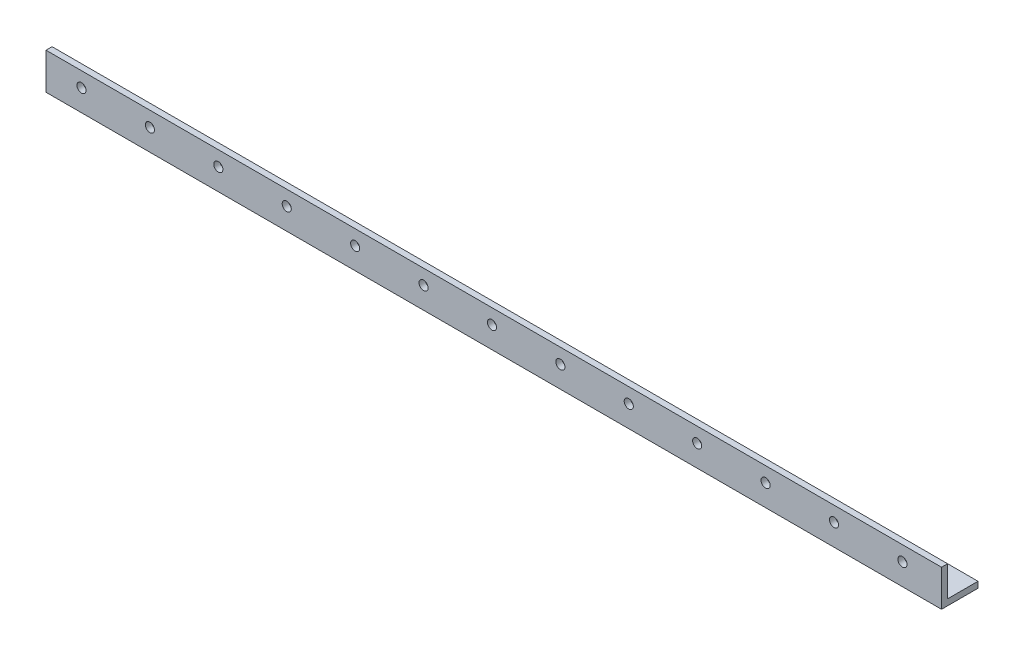
ISO-10303-21;
HEADER;
FILE_DESCRIPTION(('STEP AP214'),'2;1');
FILE_NAME('part.step','',(''),(''),'','','');
FILE_SCHEMA(('AUTOMOTIVE_DESIGN { 1 0 10303 214 1 1 1 1 }'));
ENDSEC;
DATA;
#1=APPLICATION_CONTEXT('core data for automotive mechanical design processes');
#2=APPLICATION_PROTOCOL_DEFINITION('international standard','automotive_design',2000,#1);
#3=PRODUCT_CONTEXT('',#1,'mechanical');
#4=PRODUCT('Part','Part','',(#3));
#5=PRODUCT_RELATED_PRODUCT_CATEGORY('part','',(#4));
#6=PRODUCT_DEFINITION_FORMATION('','',#4);
#7=PRODUCT_DEFINITION_CONTEXT('part definition',#1,'design');
#8=PRODUCT_DEFINITION('design','',#6,#7);
#9=PRODUCT_DEFINITION_SHAPE('','',#8);
#10=(LENGTH_UNIT() NAMED_UNIT(*) SI_UNIT(.MILLI.,.METRE.));
#11=(NAMED_UNIT(*) PLANE_ANGLE_UNIT() SI_UNIT($,.RADIAN.));
#12=(NAMED_UNIT(*) SI_UNIT($,.STERADIAN.) SOLID_ANGLE_UNIT());
#13=UNCERTAINTY_MEASURE_WITH_UNIT(LENGTH_MEASURE(1.E-05),#10,'distance_accuracy_value','');
#14=(GEOMETRIC_REPRESENTATION_CONTEXT(3) GLOBAL_UNCERTAINTY_ASSIGNED_CONTEXT((#13)) GLOBAL_UNIT_ASSIGNED_CONTEXT((#10,
#11,#12)) REPRESENTATION_CONTEXT('',''));
#15=CARTESIAN_POINT('',(0.,0.,0.));
#16=DIRECTION('',(0.,0.,1.));
#17=DIRECTION('',(1.,0.,0.));
#18=AXIS2_PLACEMENT_3D('',#15,#16,#17);
#19=CARTESIAN_POINT('',(-468.,0.,-19.05));
#20=DIRECTION('',(0.,-1.,0.));
#21=DIRECTION('',(0.,0.,-1.));
#22=AXIS2_PLACEMENT_3D('',#19,#20,#21);
#23=PLANE('',#22);
#24=DIRECTION('',(0.,0.,-1.));
#25=VECTOR('',#24,1.);
#26=CARTESIAN_POINT('',(0.,0.,-19.05));
#27=LINE('',#26,#25);
#28=CARTESIAN_POINT('',(0.,0.,0.));
#29=VERTEX_POINT('',#28);
#30=CARTESIAN_POINT('',(0.,0.,-19.05));
#31=VERTEX_POINT('',#30);
#32=EDGE_CURVE('E118',#29,#31,#27,.T.);
#33=ORIENTED_EDGE('',*,*,#32,.F.);
#34=DIRECTION('',(1.,0.,0.));
#35=VECTOR('',#34,1.);
#36=CARTESIAN_POINT('',(-468.,0.,0.));
#37=LINE('',#36,#35);
#38=CARTESIAN_POINT('',(-468.,0.,0.));
#39=VERTEX_POINT('',#38);
#40=EDGE_CURVE('E11',#39,#29,#37,.T.);
#41=ORIENTED_EDGE('',*,*,#40,.F.);
#42=DIRECTION('',(0.,0.,-1.));
#43=VECTOR('',#42,1.);
#44=CARTESIAN_POINT('',(-468.,0.,-19.05));
#45=LINE('',#44,#43);
#46=CARTESIAN_POINT('',(-468.,0.,-19.05));
#47=VERTEX_POINT('',#46);
#48=EDGE_CURVE('E133',#39,#47,#45,.T.);
#49=ORIENTED_EDGE('',*,*,#48,.T.);
#50=DIRECTION('',(1.,0.,0.));
#51=VECTOR('',#50,1.);
#52=CARTESIAN_POINT('',(-468.,0.,-19.05));
#53=LINE('',#52,#51);
#54=EDGE_CURVE('E36',#47,#31,#53,.T.);
#55=ORIENTED_EDGE('',*,*,#54,.T.);
#56=EDGE_LOOP('',(#33,#41,#49,#55));
#57=FACE_BOUND('',#56,.T.);
#58=ADVANCED_FACE('F33',(#57),#23,.T.);
#59=CARTESIAN_POINT('',(-468.,0.,0.));
#60=DIRECTION('',(0.,0.,1.));
#61=DIRECTION('',(1.,0.,0.));
#62=AXIS2_PLACEMENT_3D('',#59,#60,#61);
#63=PLANE('',#62);
#64=CARTESIAN_POINT('',(-20.45,11.2735467227539,0.));
#65=DIRECTION('',(0.,0.,1.));
#66=DIRECTION('',(1.,0.,0.));
#67=AXIS2_PLACEMENT_3D('',#64,#65,#66);
#68=CIRCLE('',#67,2.38125);
#69=CARTESIAN_POINT('',(-18.06875,11.2735467227539,0.));
#70=VERTEX_POINT('',#69);
#71=EDGE_CURVE('E227',#70,#70,#68,.T.);
#72=ORIENTED_EDGE('',*,*,#71,.F.);
#73=EDGE_LOOP('',(#72));
#74=FACE_BOUND('',#73,.T.);
#75=CARTESIAN_POINT('',(-56.2,11.2735467227539,0.));
#76=DIRECTION('',(0.,0.,1.));
#77=DIRECTION('',(1.,0.,0.));
#78=AXIS2_PLACEMENT_3D('',#75,#76,#77);
#79=CIRCLE('',#78,2.38125);
#80=CARTESIAN_POINT('',(-53.81875,11.2735467227539,0.));
#81=VERTEX_POINT('',#80);
#82=EDGE_CURVE('E229',#81,#81,#79,.T.);
#83=ORIENTED_EDGE('',*,*,#82,.F.);
#84=EDGE_LOOP('',(#83));
#85=FACE_BOUND('',#84,.T.);
#86=CARTESIAN_POINT('',(-91.95,11.2735467227539,0.));
#87=DIRECTION('',(0.,0.,1.));
#88=DIRECTION('',(1.,0.,0.));
#89=AXIS2_PLACEMENT_3D('',#86,#87,#88);
#90=CIRCLE('',#89,2.38125000000001);
#91=CARTESIAN_POINT('',(-89.56875,11.2735467227539,0.));
#92=VERTEX_POINT('',#91);
#93=EDGE_CURVE('E235',#92,#92,#90,.T.);
#94=ORIENTED_EDGE('',*,*,#93,.F.);
#95=EDGE_LOOP('',(#94));
#96=FACE_BOUND('',#95,.T.);
#97=CARTESIAN_POINT('',(-127.7,11.2735467227539,0.));
#98=DIRECTION('',(0.,0.,1.));
#99=DIRECTION('',(1.,0.,0.));
#100=AXIS2_PLACEMENT_3D('',#97,#98,#99);
#101=CIRCLE('',#100,2.38125000000001);
#102=CARTESIAN_POINT('',(-125.31875,11.2735467227539,0.));
#103=VERTEX_POINT('',#102);
#104=EDGE_CURVE('E241',#103,#103,#101,.T.);
#105=ORIENTED_EDGE('',*,*,#104,.F.);
#106=EDGE_LOOP('',(#105));
#107=FACE_BOUND('',#106,.T.);
#108=CARTESIAN_POINT('',(-163.45,11.2735467227539,0.));
#109=DIRECTION('',(0.,0.,1.));
#110=DIRECTION('',(1.,0.,0.));
#111=AXIS2_PLACEMENT_3D('',#108,#109,#110);
#112=CIRCLE('',#111,2.38125000000001);
#113=CARTESIAN_POINT('',(-161.06875,11.2735467227539,0.));
#114=VERTEX_POINT('',#113);
#115=EDGE_CURVE('E247',#114,#114,#112,.T.);
#116=ORIENTED_EDGE('',*,*,#115,.F.);
#117=EDGE_LOOP('',(#116));
#118=FACE_BOUND('',#117,.T.);
#119=CARTESIAN_POINT('',(-199.2,11.2735467227539,0.));
#120=DIRECTION('',(0.,0.,1.));
#121=DIRECTION('',(1.,0.,0.));
#122=AXIS2_PLACEMENT_3D('',#119,#120,#121);
#123=CIRCLE('',#122,2.38125000000001);
#124=CARTESIAN_POINT('',(-196.81875,11.2735467227539,0.));
#125=VERTEX_POINT('',#124);
#126=EDGE_CURVE('E253',#125,#125,#123,.T.);
#127=ORIENTED_EDGE('',*,*,#126,.F.);
#128=EDGE_LOOP('',(#127));
#129=FACE_BOUND('',#128,.T.);
#130=CARTESIAN_POINT('',(-234.95,11.2735467227539,0.));
#131=DIRECTION('',(0.,0.,1.));
#132=DIRECTION('',(1.,0.,0.));
#133=AXIS2_PLACEMENT_3D('',#130,#131,#132);
#134=CIRCLE('',#133,2.38125000000001);
#135=CARTESIAN_POINT('',(-232.56875,11.2735467227539,0.));
#136=VERTEX_POINT('',#135);
#137=EDGE_CURVE('E259',#136,#136,#134,.T.);
#138=ORIENTED_EDGE('',*,*,#137,.F.);
#139=EDGE_LOOP('',(#138));
#140=FACE_BOUND('',#139,.T.);
#141=CARTESIAN_POINT('',(-270.7,11.2735467227539,0.));
#142=DIRECTION('',(0.,0.,1.));
#143=DIRECTION('',(1.,0.,0.));
#144=AXIS2_PLACEMENT_3D('',#141,#142,#143);
#145=CIRCLE('',#144,2.38125000000001);
#146=CARTESIAN_POINT('',(-268.31875,11.2735467227539,0.));
#147=VERTEX_POINT('',#146);
#148=EDGE_CURVE('E265',#147,#147,#145,.T.);
#149=ORIENTED_EDGE('',*,*,#148,.F.);
#150=EDGE_LOOP('',(#149));
#151=FACE_BOUND('',#150,.T.);
#152=CARTESIAN_POINT('',(-306.45,11.2735467227539,0.));
#153=DIRECTION('',(0.,0.,1.));
#154=DIRECTION('',(1.,0.,0.));
#155=AXIS2_PLACEMENT_3D('',#152,#153,#154);
#156=CIRCLE('',#155,2.38125000000001);
#157=CARTESIAN_POINT('',(-304.06875,11.2735467227539,0.));
#158=VERTEX_POINT('',#157);
#159=EDGE_CURVE('E271',#158,#158,#156,.T.);
#160=ORIENTED_EDGE('',*,*,#159,.F.);
#161=EDGE_LOOP('',(#160));
#162=FACE_BOUND('',#161,.T.);
#163=CARTESIAN_POINT('',(-342.2,11.2735467227539,0.));
#164=DIRECTION('',(0.,0.,1.));
#165=DIRECTION('',(1.,0.,0.));
#166=AXIS2_PLACEMENT_3D('',#163,#164,#165);
#167=CIRCLE('',#166,2.38125000000001);
#168=CARTESIAN_POINT('',(-339.81875,11.2735467227539,0.));
#169=VERTEX_POINT('',#168);
#170=EDGE_CURVE('E277',#169,#169,#167,.T.);
#171=ORIENTED_EDGE('',*,*,#170,.F.);
#172=EDGE_LOOP('',(#171));
#173=FACE_BOUND('',#172,.T.);
#174=CARTESIAN_POINT('',(-377.95,11.2735467227539,0.));
#175=DIRECTION('',(0.,0.,1.));
#176=DIRECTION('',(1.,0.,0.));
#177=AXIS2_PLACEMENT_3D('',#174,#175,#176);
#178=CIRCLE('',#177,2.38125000000001);
#179=CARTESIAN_POINT('',(-375.56875,11.2735467227539,0.));
#180=VERTEX_POINT('',#179);
#181=EDGE_CURVE('E283',#180,#180,#178,.T.);
#182=ORIENTED_EDGE('',*,*,#181,.F.);
#183=EDGE_LOOP('',(#182));
#184=FACE_BOUND('',#183,.T.);
#185=CARTESIAN_POINT('',(-413.7,11.2735467227539,0.));
#186=DIRECTION('',(0.,0.,1.));
#187=DIRECTION('',(1.,0.,0.));
#188=AXIS2_PLACEMENT_3D('',#185,#186,#187);
#189=CIRCLE('',#188,2.38125000000001);
#190=CARTESIAN_POINT('',(-411.31875,11.2735467227539,0.));
#191=VERTEX_POINT('',#190);
#192=EDGE_CURVE('E289',#191,#191,#189,.T.);
#193=ORIENTED_EDGE('',*,*,#192,.F.);
#194=EDGE_LOOP('',(#193));
#195=FACE_BOUND('',#194,.T.);
#196=CARTESIAN_POINT('',(-449.45,11.2735467227539,0.));
#197=DIRECTION('',(0.,0.,1.));
#198=DIRECTION('',(1.,0.,0.));
#199=AXIS2_PLACEMENT_3D('',#196,#197,#198);
#200=CIRCLE('',#199,2.38125000000001);
#201=CARTESIAN_POINT('',(-447.06875,11.2735467227539,0.));
#202=VERTEX_POINT('',#201);
#203=EDGE_CURVE('E295',#202,#202,#200,.T.);
#204=ORIENTED_EDGE('',*,*,#203,.F.);
#205=EDGE_LOOP('',(#204));
#206=FACE_BOUND('',#205,.T.);
#207=DIRECTION('',(0.,-1.,0.));
#208=VECTOR('',#207,1.);
#209=CARTESIAN_POINT('',(0.,0.,0.));
#210=LINE('',#209,#208);
#211=CARTESIAN_POINT('',(0.,19.05,0.));
#212=VERTEX_POINT('',#211);
#213=EDGE_CURVE('E131',#212,#29,#210,.T.);
#214=ORIENTED_EDGE('',*,*,#213,.F.);
#215=DIRECTION('',(1.,0.,0.));
#216=VECTOR('',#215,1.);
#217=CARTESIAN_POINT('',(-468.,19.05,0.));
#218=LINE('',#217,#216);
#219=CARTESIAN_POINT('',(-468.,19.05,0.));
#220=VERTEX_POINT('',#219);
#221=EDGE_CURVE('E42',#220,#212,#218,.T.);
#222=ORIENTED_EDGE('',*,*,#221,.F.);
#223=DIRECTION('',(0.,-1.,0.));
#224=VECTOR('',#223,1.);
#225=CARTESIAN_POINT('',(-468.,0.,0.));
#226=LINE('',#225,#224);
#227=EDGE_CURVE('E108',#220,#39,#226,.T.);
#228=ORIENTED_EDGE('',*,*,#227,.T.);
#229=ORIENTED_EDGE('',*,*,#40,.T.);
#230=EDGE_LOOP('',(#214,#222,#228,#229));
#231=FACE_BOUND('',#230,.T.);
#232=ADVANCED_FACE('F141',(#74,#85,#96,#107,#118,#129,#140,#151,#162,#173,#184,#195,#206,#231),
#63,.T.);
#233=CARTESIAN_POINT('',(-468.,19.05,0.));
#234=DIRECTION('',(0.,1.,0.));
#235=DIRECTION('',(0.,0.,1.));
#236=AXIS2_PLACEMENT_3D('',#233,#234,#235);
#237=PLANE('',#236);
#238=DIRECTION('',(0.,0.,1.));
#239=VECTOR('',#238,1.);
#240=CARTESIAN_POINT('',(0.,19.05,0.));
#241=LINE('',#240,#239);
#242=CARTESIAN_POINT('',(0.,19.05,-3.175));
#243=VERTEX_POINT('',#242);
#244=EDGE_CURVE('E95',#243,#212,#241,.T.);
#245=ORIENTED_EDGE('',*,*,#244,.F.);
#246=DIRECTION('',(1.,0.,0.));
#247=VECTOR('',#246,1.);
#248=CARTESIAN_POINT('',(-468.,19.05,-3.175));
#249=LINE('',#248,#247);
#250=CARTESIAN_POINT('',(-468.,19.05,-3.175));
#251=VERTEX_POINT('',#250);
#252=EDGE_CURVE('E90',#251,#243,#249,.T.);
#253=ORIENTED_EDGE('',*,*,#252,.F.);
#254=DIRECTION('',(0.,0.,1.));
#255=VECTOR('',#254,1.);
#256=CARTESIAN_POINT('',(-468.,19.05,0.));
#257=LINE('',#256,#255);
#258=EDGE_CURVE('E93',#251,#220,#257,.T.);
#259=ORIENTED_EDGE('',*,*,#258,.T.);
#260=ORIENTED_EDGE('',*,*,#221,.T.);
#261=EDGE_LOOP('',(#245,#253,#259,#260));
#262=FACE_BOUND('',#261,.T.);
#263=ADVANCED_FACE('F92',(#262),#237,.T.);
#264=CARTESIAN_POINT('',(-468.,19.05,-3.175));
#265=DIRECTION('',(0.,0.,-1.));
#266=DIRECTION('',(0.,1.,0.));
#267=AXIS2_PLACEMENT_3D('',#264,#265,#266);
#268=PLANE('',#267);
#269=CARTESIAN_POINT('',(-20.45,11.2735467227539,-3.175));
#270=DIRECTION('',(0.,0.,1.));
#271=DIRECTION('',(1.,0.,0.));
#272=AXIS2_PLACEMENT_3D('',#269,#270,#271);
#273=CIRCLE('',#272,2.38125);
#274=CARTESIAN_POINT('',(-18.06875,11.2735467227539,-3.175));
#275=VERTEX_POINT('',#274);
#276=EDGE_CURVE('E225',#275,#275,#273,.T.);
#277=ORIENTED_EDGE('',*,*,#276,.T.);
#278=EDGE_LOOP('',(#277));
#279=FACE_BOUND('',#278,.T.);
#280=CARTESIAN_POINT('',(-56.2,11.2735467227539,-3.175));
#281=DIRECTION('',(0.,0.,1.));
#282=DIRECTION('',(1.,0.,0.));
#283=AXIS2_PLACEMENT_3D('',#280,#281,#282);
#284=CIRCLE('',#283,2.38125);
#285=CARTESIAN_POINT('',(-53.81875,11.2735467227539,-3.175));
#286=VERTEX_POINT('',#285);
#287=EDGE_CURVE('E232',#286,#286,#284,.T.);
#288=ORIENTED_EDGE('',*,*,#287,.T.);
#289=EDGE_LOOP('',(#288));
#290=FACE_BOUND('',#289,.T.);
#291=CARTESIAN_POINT('',(-91.95,11.2735467227539,-3.175));
#292=DIRECTION('',(0.,0.,1.));
#293=DIRECTION('',(1.,0.,0.));
#294=AXIS2_PLACEMENT_3D('',#291,#292,#293);
#295=CIRCLE('',#294,2.38125000000001);
#296=CARTESIAN_POINT('',(-89.56875,11.2735467227539,-3.175));
#297=VERTEX_POINT('',#296);
#298=EDGE_CURVE('E238',#297,#297,#295,.T.);
#299=ORIENTED_EDGE('',*,*,#298,.T.);
#300=EDGE_LOOP('',(#299));
#301=FACE_BOUND('',#300,.T.);
#302=CARTESIAN_POINT('',(-127.7,11.2735467227539,-3.175));
#303=DIRECTION('',(0.,0.,1.));
#304=DIRECTION('',(1.,0.,0.));
#305=AXIS2_PLACEMENT_3D('',#302,#303,#304);
#306=CIRCLE('',#305,2.38125000000001);
#307=CARTESIAN_POINT('',(-125.31875,11.2735467227539,-3.175));
#308=VERTEX_POINT('',#307);
#309=EDGE_CURVE('E244',#308,#308,#306,.T.);
#310=ORIENTED_EDGE('',*,*,#309,.T.);
#311=EDGE_LOOP('',(#310));
#312=FACE_BOUND('',#311,.T.);
#313=CARTESIAN_POINT('',(-163.45,11.2735467227539,-3.175));
#314=DIRECTION('',(0.,0.,1.));
#315=DIRECTION('',(1.,0.,0.));
#316=AXIS2_PLACEMENT_3D('',#313,#314,#315);
#317=CIRCLE('',#316,2.38125000000001);
#318=CARTESIAN_POINT('',(-161.06875,11.2735467227539,-3.175));
#319=VERTEX_POINT('',#318);
#320=EDGE_CURVE('E250',#319,#319,#317,.T.);
#321=ORIENTED_EDGE('',*,*,#320,.T.);
#322=EDGE_LOOP('',(#321));
#323=FACE_BOUND('',#322,.T.);
#324=CARTESIAN_POINT('',(-199.2,11.2735467227539,-3.175));
#325=DIRECTION('',(0.,0.,1.));
#326=DIRECTION('',(1.,0.,0.));
#327=AXIS2_PLACEMENT_3D('',#324,#325,#326);
#328=CIRCLE('',#327,2.38125000000001);
#329=CARTESIAN_POINT('',(-196.81875,11.2735467227539,-3.175));
#330=VERTEX_POINT('',#329);
#331=EDGE_CURVE('E256',#330,#330,#328,.T.);
#332=ORIENTED_EDGE('',*,*,#331,.T.);
#333=EDGE_LOOP('',(#332));
#334=FACE_BOUND('',#333,.T.);
#335=CARTESIAN_POINT('',(-234.95,11.2735467227539,-3.175));
#336=DIRECTION('',(0.,0.,1.));
#337=DIRECTION('',(1.,0.,0.));
#338=AXIS2_PLACEMENT_3D('',#335,#336,#337);
#339=CIRCLE('',#338,2.38125000000001);
#340=CARTESIAN_POINT('',(-232.56875,11.2735467227539,-3.175));
#341=VERTEX_POINT('',#340);
#342=EDGE_CURVE('E262',#341,#341,#339,.T.);
#343=ORIENTED_EDGE('',*,*,#342,.T.);
#344=EDGE_LOOP('',(#343));
#345=FACE_BOUND('',#344,.T.);
#346=CARTESIAN_POINT('',(-270.7,11.2735467227539,-3.175));
#347=DIRECTION('',(0.,0.,1.));
#348=DIRECTION('',(1.,0.,0.));
#349=AXIS2_PLACEMENT_3D('',#346,#347,#348);
#350=CIRCLE('',#349,2.38125000000001);
#351=CARTESIAN_POINT('',(-268.31875,11.2735467227539,-3.175));
#352=VERTEX_POINT('',#351);
#353=EDGE_CURVE('E268',#352,#352,#350,.T.);
#354=ORIENTED_EDGE('',*,*,#353,.T.);
#355=EDGE_LOOP('',(#354));
#356=FACE_BOUND('',#355,.T.);
#357=CARTESIAN_POINT('',(-306.45,11.2735467227539,-3.175));
#358=DIRECTION('',(0.,0.,1.));
#359=DIRECTION('',(1.,0.,0.));
#360=AXIS2_PLACEMENT_3D('',#357,#358,#359);
#361=CIRCLE('',#360,2.38125000000001);
#362=CARTESIAN_POINT('',(-304.06875,11.2735467227539,-3.175));
#363=VERTEX_POINT('',#362);
#364=EDGE_CURVE('E274',#363,#363,#361,.T.);
#365=ORIENTED_EDGE('',*,*,#364,.T.);
#366=EDGE_LOOP('',(#365));
#367=FACE_BOUND('',#366,.T.);
#368=CARTESIAN_POINT('',(-342.2,11.2735467227539,-3.175));
#369=DIRECTION('',(0.,0.,1.));
#370=DIRECTION('',(1.,0.,0.));
#371=AXIS2_PLACEMENT_3D('',#368,#369,#370);
#372=CIRCLE('',#371,2.38125000000001);
#373=CARTESIAN_POINT('',(-339.81875,11.2735467227539,-3.175));
#374=VERTEX_POINT('',#373);
#375=EDGE_CURVE('E280',#374,#374,#372,.T.);
#376=ORIENTED_EDGE('',*,*,#375,.T.);
#377=EDGE_LOOP('',(#376));
#378=FACE_BOUND('',#377,.T.);
#379=CARTESIAN_POINT('',(-377.95,11.2735467227539,-3.175));
#380=DIRECTION('',(0.,0.,1.));
#381=DIRECTION('',(1.,0.,0.));
#382=AXIS2_PLACEMENT_3D('',#379,#380,#381);
#383=CIRCLE('',#382,2.38125000000001);
#384=CARTESIAN_POINT('',(-375.56875,11.2735467227539,-3.175));
#385=VERTEX_POINT('',#384);
#386=EDGE_CURVE('E286',#385,#385,#383,.T.);
#387=ORIENTED_EDGE('',*,*,#386,.T.);
#388=EDGE_LOOP('',(#387));
#389=FACE_BOUND('',#388,.T.);
#390=CARTESIAN_POINT('',(-413.7,11.2735467227539,-3.175));
#391=DIRECTION('',(0.,0.,1.));
#392=DIRECTION('',(1.,0.,0.));
#393=AXIS2_PLACEMENT_3D('',#390,#391,#392);
#394=CIRCLE('',#393,2.38125000000001);
#395=CARTESIAN_POINT('',(-411.31875,11.2735467227539,-3.175));
#396=VERTEX_POINT('',#395);
#397=EDGE_CURVE('E292',#396,#396,#394,.T.);
#398=ORIENTED_EDGE('',*,*,#397,.T.);
#399=EDGE_LOOP('',(#398));
#400=FACE_BOUND('',#399,.T.);
#401=CARTESIAN_POINT('',(-449.45,11.2735467227539,-3.175));
#402=DIRECTION('',(0.,0.,1.));
#403=DIRECTION('',(1.,0.,0.));
#404=AXIS2_PLACEMENT_3D('',#401,#402,#403);
#405=CIRCLE('',#404,2.38125000000001);
#406=CARTESIAN_POINT('',(-447.06875,11.2735467227539,-3.175));
#407=VERTEX_POINT('',#406);
#408=EDGE_CURVE('E122',#407,#407,#405,.T.);
#409=ORIENTED_EDGE('',*,*,#408,.T.);
#410=EDGE_LOOP('',(#409));
#411=FACE_BOUND('',#410,.T.);
#412=DIRECTION('',(0.,1.,0.));
#413=VECTOR('',#412,1.);
#414=CARTESIAN_POINT('',(0.,19.05,-3.175));
#415=LINE('',#414,#413);
#416=CARTESIAN_POINT('',(0.,3.175,-3.175));
#417=VERTEX_POINT('',#416);
#418=EDGE_CURVE('E128',#417,#243,#415,.T.);
#419=ORIENTED_EDGE('',*,*,#418,.F.);
#420=DIRECTION('',(1.,0.,0.));
#421=VECTOR('',#420,1.);
#422=CARTESIAN_POINT('',(-468.,3.175,-3.175));
#423=LINE('',#422,#421);
#424=CARTESIAN_POINT('',(-468.,3.175,-3.175));
#425=VERTEX_POINT('',#424);
#426=EDGE_CURVE('E100',#425,#417,#423,.T.);
#427=ORIENTED_EDGE('',*,*,#426,.F.);
#428=DIRECTION('',(0.,1.,0.));
#429=VECTOR('',#428,1.);
#430=CARTESIAN_POINT('',(-468.,19.05,-3.175));
#431=LINE('',#430,#429);
#432=EDGE_CURVE('E106',#425,#251,#431,.T.);
#433=ORIENTED_EDGE('',*,*,#432,.T.);
#434=ORIENTED_EDGE('',*,*,#252,.T.);
#435=EDGE_LOOP('',(#419,#427,#433,#434));
#436=FACE_BOUND('',#435,.T.);
#437=ADVANCED_FACE('F110',(#279,#290,#301,#312,#323,#334,#345,#356,#367,#378,#389,#400,#411,
#436),#268,.T.);
#438=CARTESIAN_POINT('',(-468.,3.175,-3.175));
#439=DIRECTION('',(0.,1.,0.));
#440=DIRECTION('',(0.,0.,1.));
#441=AXIS2_PLACEMENT_3D('',#438,#439,#440);
#442=PLANE('',#441);
#443=DIRECTION('',(0.,0.,1.));
#444=VECTOR('',#443,1.);
#445=CARTESIAN_POINT('',(0.,3.175,-3.175));
#446=LINE('',#445,#444);
#447=CARTESIAN_POINT('',(0.,3.175,-19.05));
#448=VERTEX_POINT('',#447);
#449=EDGE_CURVE('E125',#448,#417,#446,.T.);
#450=ORIENTED_EDGE('',*,*,#449,.F.);
#451=DIRECTION('',(1.,0.,0.));
#452=VECTOR('',#451,1.);
#453=CARTESIAN_POINT('',(-468.,3.175,-19.05));
#454=LINE('',#453,#452);
#455=CARTESIAN_POINT('',(-468.,3.175,-19.05));
#456=VERTEX_POINT('',#455);
#457=EDGE_CURVE('E136',#456,#448,#454,.T.);
#458=ORIENTED_EDGE('',*,*,#457,.F.);
#459=DIRECTION('',(0.,0.,1.));
#460=VECTOR('',#459,1.);
#461=CARTESIAN_POINT('',(-468.,3.175,-3.175));
#462=LINE('',#461,#460);
#463=EDGE_CURVE('E111',#456,#425,#462,.T.);
#464=ORIENTED_EDGE('',*,*,#463,.T.);
#465=ORIENTED_EDGE('',*,*,#426,.T.);
#466=EDGE_LOOP('',(#450,#458,#464,#465));
#467=FACE_BOUND('',#466,.T.);
#468=ADVANCED_FACE('F157',(#467),#442,.T.);
#469=CARTESIAN_POINT('',(-468.,3.175,-19.05));
#470=DIRECTION('',(0.,0.,-1.));
#471=DIRECTION('',(0.,1.,0.));
#472=AXIS2_PLACEMENT_3D('',#469,#470,#471);
#473=PLANE('',#472);
#474=DIRECTION('',(0.,1.,0.));
#475=VECTOR('',#474,1.);
#476=CARTESIAN_POINT('',(0.,3.175,-19.05));
#477=LINE('',#476,#475);
#478=EDGE_CURVE('E121',#31,#448,#477,.T.);
#479=ORIENTED_EDGE('',*,*,#478,.F.);
#480=ORIENTED_EDGE('',*,*,#54,.F.);
#481=DIRECTION('',(0.,1.,0.));
#482=VECTOR('',#481,1.);
#483=CARTESIAN_POINT('',(-468.,3.175,-19.05));
#484=LINE('',#483,#482);
#485=EDGE_CURVE('E113',#47,#456,#484,.T.);
#486=ORIENTED_EDGE('',*,*,#485,.T.);
#487=ORIENTED_EDGE('',*,*,#457,.T.);
#488=EDGE_LOOP('',(#479,#480,#486,#487));
#489=FACE_BOUND('',#488,.T.);
#490=ADVANCED_FACE('F138',(#489),#473,.T.);
#491=CARTESIAN_POINT('',(-468.,0.,0.));
#492=DIRECTION('',(-1.,0.,0.));
#493=DIRECTION('',(0.,0.,1.));
#494=AXIS2_PLACEMENT_3D('',#491,#492,#493);
#495=PLANE('',#494);
#496=ORIENTED_EDGE('',*,*,#48,.F.);
#497=ORIENTED_EDGE('',*,*,#227,.F.);
#498=ORIENTED_EDGE('',*,*,#258,.F.);
#499=ORIENTED_EDGE('',*,*,#432,.F.);
#500=ORIENTED_EDGE('',*,*,#463,.F.);
#501=ORIENTED_EDGE('',*,*,#485,.F.);
#502=EDGE_LOOP('',(#496,#497,#498,#499,#500,#501));
#503=FACE_BOUND('',#502,.T.);
#504=ADVANCED_FACE('F104',(#503),#495,.T.);
#505=CARTESIAN_POINT('',(0.,0.,0.));
#506=DIRECTION('',(-1.,0.,0.));
#507=DIRECTION('',(0.,0.,1.));
#508=AXIS2_PLACEMENT_3D('',#505,#506,#507);
#509=PLANE('',#508);
#510=ORIENTED_EDGE('',*,*,#32,.T.);
#511=ORIENTED_EDGE('',*,*,#478,.T.);
#512=ORIENTED_EDGE('',*,*,#449,.T.);
#513=ORIENTED_EDGE('',*,*,#418,.T.);
#514=ORIENTED_EDGE('',*,*,#244,.T.);
#515=ORIENTED_EDGE('',*,*,#213,.T.);
#516=EDGE_LOOP('',(#510,#511,#512,#513,#514,#515));
#517=FACE_BOUND('',#516,.T.);
#518=ADVANCED_FACE('F140',(#517),#509,.F.);
#519=CARTESIAN_POINT('',(-449.45,11.2735467227539,-3.175));
#520=DIRECTION('',(0.,0.,1.));
#521=DIRECTION('',(1.,0.,0.));
#522=AXIS2_PLACEMENT_3D('',#519,#520,#521);
#523=CYLINDRICAL_SURFACE('',#522,2.38125000000001);
#524=ORIENTED_EDGE('',*,*,#408,.F.);
#525=EDGE_LOOP('',(#524));
#526=FACE_BOUND('',#525,.T.);
#527=ORIENTED_EDGE('',*,*,#203,.T.);
#528=EDGE_LOOP('',(#527));
#529=FACE_BOUND('',#528,.T.);
#530=ADVANCED_FACE('F168',(#526,#529),#523,.F.);
#531=CARTESIAN_POINT('',(-413.7,11.2735467227539,-3.175));
#532=DIRECTION('',(0.,0.,1.));
#533=DIRECTION('',(1.,0.,0.));
#534=AXIS2_PLACEMENT_3D('',#531,#532,#533);
#535=CYLINDRICAL_SURFACE('',#534,2.38125000000001);
#536=ORIENTED_EDGE('',*,*,#397,.F.);
#537=EDGE_LOOP('',(#536));
#538=FACE_BOUND('',#537,.T.);
#539=ORIENTED_EDGE('',*,*,#192,.T.);
#540=EDGE_LOOP('',(#539));
#541=FACE_BOUND('',#540,.T.);
#542=ADVANCED_FACE('F172',(#538,#541),#535,.F.);
#543=CARTESIAN_POINT('',(-377.95,11.2735467227539,-3.175));
#544=DIRECTION('',(0.,0.,1.));
#545=DIRECTION('',(1.,0.,0.));
#546=AXIS2_PLACEMENT_3D('',#543,#544,#545);
#547=CYLINDRICAL_SURFACE('',#546,2.38125000000001);
#548=ORIENTED_EDGE('',*,*,#386,.F.);
#549=EDGE_LOOP('',(#548));
#550=FACE_BOUND('',#549,.T.);
#551=ORIENTED_EDGE('',*,*,#181,.T.);
#552=EDGE_LOOP('',(#551));
#553=FACE_BOUND('',#552,.T.);
#554=ADVANCED_FACE('F176',(#550,#553),#547,.F.);
#555=CARTESIAN_POINT('',(-342.2,11.2735467227539,-3.175));
#556=DIRECTION('',(0.,0.,1.));
#557=DIRECTION('',(1.,0.,0.));
#558=AXIS2_PLACEMENT_3D('',#555,#556,#557);
#559=CYLINDRICAL_SURFACE('',#558,2.38125000000001);
#560=ORIENTED_EDGE('',*,*,#375,.F.);
#561=EDGE_LOOP('',(#560));
#562=FACE_BOUND('',#561,.T.);
#563=ORIENTED_EDGE('',*,*,#170,.T.);
#564=EDGE_LOOP('',(#563));
#565=FACE_BOUND('',#564,.T.);
#566=ADVANCED_FACE('F180',(#562,#565),#559,.F.);
#567=CARTESIAN_POINT('',(-306.45,11.2735467227539,-3.175));
#568=DIRECTION('',(0.,0.,1.));
#569=DIRECTION('',(1.,0.,0.));
#570=AXIS2_PLACEMENT_3D('',#567,#568,#569);
#571=CYLINDRICAL_SURFACE('',#570,2.38125000000001);
#572=ORIENTED_EDGE('',*,*,#364,.F.);
#573=EDGE_LOOP('',(#572));
#574=FACE_BOUND('',#573,.T.);
#575=ORIENTED_EDGE('',*,*,#159,.T.);
#576=EDGE_LOOP('',(#575));
#577=FACE_BOUND('',#576,.T.);
#578=ADVANCED_FACE('F184',(#574,#577),#571,.F.);
#579=CARTESIAN_POINT('',(-270.7,11.2735467227539,-3.175));
#580=DIRECTION('',(0.,0.,1.));
#581=DIRECTION('',(1.,0.,0.));
#582=AXIS2_PLACEMENT_3D('',#579,#580,#581);
#583=CYLINDRICAL_SURFACE('',#582,2.38125000000001);
#584=ORIENTED_EDGE('',*,*,#353,.F.);
#585=EDGE_LOOP('',(#584));
#586=FACE_BOUND('',#585,.T.);
#587=ORIENTED_EDGE('',*,*,#148,.T.);
#588=EDGE_LOOP('',(#587));
#589=FACE_BOUND('',#588,.T.);
#590=ADVANCED_FACE('F188',(#586,#589),#583,.F.);
#591=CARTESIAN_POINT('',(-234.95,11.2735467227539,-3.175));
#592=DIRECTION('',(0.,0.,1.));
#593=DIRECTION('',(1.,0.,0.));
#594=AXIS2_PLACEMENT_3D('',#591,#592,#593);
#595=CYLINDRICAL_SURFACE('',#594,2.38125000000001);
#596=ORIENTED_EDGE('',*,*,#342,.F.);
#597=EDGE_LOOP('',(#596));
#598=FACE_BOUND('',#597,.T.);
#599=ORIENTED_EDGE('',*,*,#137,.T.);
#600=EDGE_LOOP('',(#599));
#601=FACE_BOUND('',#600,.T.);
#602=ADVANCED_FACE('F192',(#598,#601),#595,.F.);
#603=CARTESIAN_POINT('',(-199.2,11.2735467227539,-3.175));
#604=DIRECTION('',(0.,0.,1.));
#605=DIRECTION('',(1.,0.,0.));
#606=AXIS2_PLACEMENT_3D('',#603,#604,#605);
#607=CYLINDRICAL_SURFACE('',#606,2.38125000000001);
#608=ORIENTED_EDGE('',*,*,#331,.F.);
#609=EDGE_LOOP('',(#608));
#610=FACE_BOUND('',#609,.T.);
#611=ORIENTED_EDGE('',*,*,#126,.T.);
#612=EDGE_LOOP('',(#611));
#613=FACE_BOUND('',#612,.T.);
#614=ADVANCED_FACE('F196',(#610,#613),#607,.F.);
#615=CARTESIAN_POINT('',(-163.45,11.2735467227539,-3.175));
#616=DIRECTION('',(0.,0.,1.));
#617=DIRECTION('',(1.,0.,0.));
#618=AXIS2_PLACEMENT_3D('',#615,#616,#617);
#619=CYLINDRICAL_SURFACE('',#618,2.38125000000001);
#620=ORIENTED_EDGE('',*,*,#320,.F.);
#621=EDGE_LOOP('',(#620));
#622=FACE_BOUND('',#621,.T.);
#623=ORIENTED_EDGE('',*,*,#115,.T.);
#624=EDGE_LOOP('',(#623));
#625=FACE_BOUND('',#624,.T.);
#626=ADVANCED_FACE('F200',(#622,#625),#619,.F.);
#627=CARTESIAN_POINT('',(-127.7,11.2735467227539,-3.175));
#628=DIRECTION('',(0.,0.,1.));
#629=DIRECTION('',(1.,0.,0.));
#630=AXIS2_PLACEMENT_3D('',#627,#628,#629);
#631=CYLINDRICAL_SURFACE('',#630,2.38125000000001);
#632=ORIENTED_EDGE('',*,*,#309,.F.);
#633=EDGE_LOOP('',(#632));
#634=FACE_BOUND('',#633,.T.);
#635=ORIENTED_EDGE('',*,*,#104,.T.);
#636=EDGE_LOOP('',(#635));
#637=FACE_BOUND('',#636,.T.);
#638=ADVANCED_FACE('F204',(#634,#637),#631,.F.);
#639=CARTESIAN_POINT('',(-91.95,11.2735467227539,-3.175));
#640=DIRECTION('',(0.,0.,1.));
#641=DIRECTION('',(1.,0.,0.));
#642=AXIS2_PLACEMENT_3D('',#639,#640,#641);
#643=CYLINDRICAL_SURFACE('',#642,2.38125000000001);
#644=ORIENTED_EDGE('',*,*,#298,.F.);
#645=EDGE_LOOP('',(#644));
#646=FACE_BOUND('',#645,.T.);
#647=ORIENTED_EDGE('',*,*,#93,.T.);
#648=EDGE_LOOP('',(#647));
#649=FACE_BOUND('',#648,.T.);
#650=ADVANCED_FACE('F208',(#646,#649),#643,.F.);
#651=CARTESIAN_POINT('',(-56.2,11.2735467227539,-3.175));
#652=DIRECTION('',(0.,0.,1.));
#653=DIRECTION('',(1.,0.,0.));
#654=AXIS2_PLACEMENT_3D('',#651,#652,#653);
#655=CYLINDRICAL_SURFACE('',#654,2.38125);
#656=ORIENTED_EDGE('',*,*,#287,.F.);
#657=EDGE_LOOP('',(#656));
#658=FACE_BOUND('',#657,.T.);
#659=ORIENTED_EDGE('',*,*,#82,.T.);
#660=EDGE_LOOP('',(#659));
#661=FACE_BOUND('',#660,.T.);
#662=ADVANCED_FACE('F212',(#658,#661),#655,.F.);
#663=CARTESIAN_POINT('',(-20.45,11.2735467227539,-3.175));
#664=DIRECTION('',(0.,0.,1.));
#665=DIRECTION('',(1.,0.,0.));
#666=AXIS2_PLACEMENT_3D('',#663,#664,#665);
#667=CYLINDRICAL_SURFACE('',#666,2.38125);
#668=ORIENTED_EDGE('',*,*,#276,.F.);
#669=EDGE_LOOP('',(#668));
#670=FACE_BOUND('',#669,.T.);
#671=ORIENTED_EDGE('',*,*,#71,.T.);
#672=EDGE_LOOP('',(#671));
#673=FACE_BOUND('',#672,.T.);
#674=ADVANCED_FACE('F216',(#670,#673),#667,.F.);
#675=CLOSED_SHELL('',(#58,#232,#263,#437,#468,#490,#504,#518,#530,#542,#554,#566,#578,#590,#602,
#614,#626,#638,#650,#662,#674));
#676=MANIFOLD_SOLID_BREP('B2',#675);
#677=ADVANCED_BREP_SHAPE_REPRESENTATION('',(#18,#676),#14);
#678=SHAPE_DEFINITION_REPRESENTATION(#9,#677);
ENDSEC;
END-ISO-10303-21;
